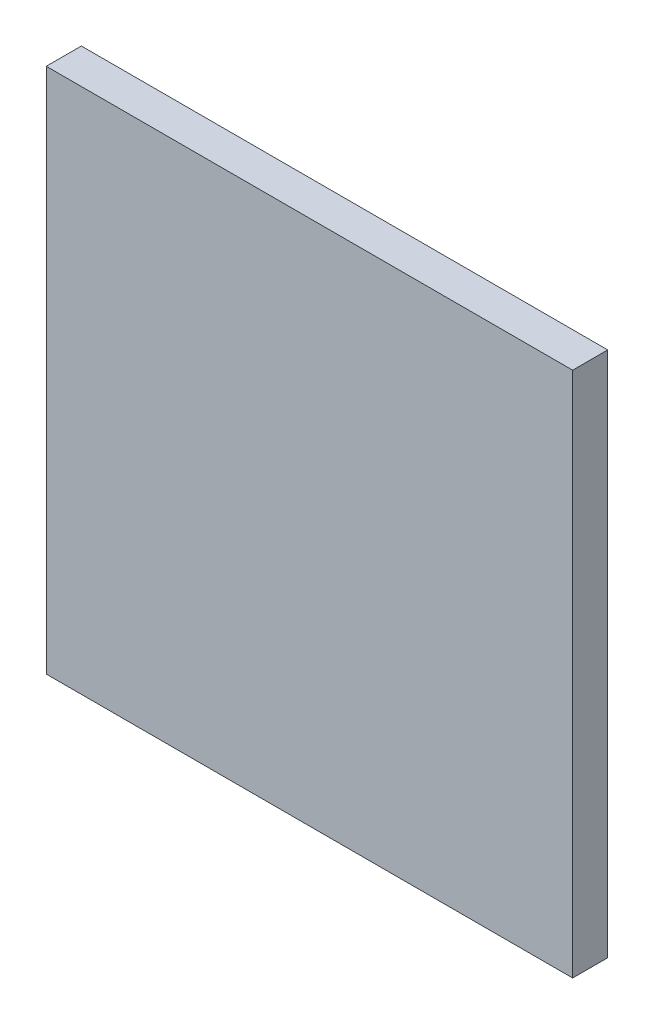
ISO-10303-21;
HEADER;
FILE_DESCRIPTION(('STEP AP214'),'2;1');
FILE_NAME('part.step','',(''),(''),'','','');
FILE_SCHEMA(('AUTOMOTIVE_DESIGN { 1 0 10303 214 1 1 1 1 }'));
ENDSEC;
DATA;
#1=APPLICATION_CONTEXT('core data for automotive mechanical design processes');
#2=APPLICATION_PROTOCOL_DEFINITION('international standard','automotive_design',2000,#1);
#3=PRODUCT_CONTEXT('',#1,'mechanical');
#4=PRODUCT('Part','Part','',(#3));
#5=PRODUCT_RELATED_PRODUCT_CATEGORY('part','',(#4));
#6=PRODUCT_DEFINITION_FORMATION('','',#4);
#7=PRODUCT_DEFINITION_CONTEXT('part definition',#1,'design');
#8=PRODUCT_DEFINITION('design','',#6,#7);
#9=PRODUCT_DEFINITION_SHAPE('','',#8);
#10=(LENGTH_UNIT() NAMED_UNIT(*) SI_UNIT(.MILLI.,.METRE.));
#11=(NAMED_UNIT(*) PLANE_ANGLE_UNIT() SI_UNIT($,.RADIAN.));
#12=(NAMED_UNIT(*) SI_UNIT($,.STERADIAN.) SOLID_ANGLE_UNIT());
#13=UNCERTAINTY_MEASURE_WITH_UNIT(LENGTH_MEASURE(1.E-05),#10,'distance_accuracy_value','');
#14=(GEOMETRIC_REPRESENTATION_CONTEXT(3) GLOBAL_UNCERTAINTY_ASSIGNED_CONTEXT((#13)) GLOBAL_UNIT_ASSIGNED_CONTEXT((#10,
#11,#12)) REPRESENTATION_CONTEXT('',''));
#15=CARTESIAN_POINT('',(0.,0.,0.));
#16=DIRECTION('',(0.,0.,1.));
#17=DIRECTION('',(1.,0.,0.));
#18=AXIS2_PLACEMENT_3D('',#15,#16,#17);
#19=CARTESIAN_POINT('',(15.,-15.,2.));
#20=DIRECTION('',(-1.,0.,0.));
#21=DIRECTION('',(0.,0.,1.));
#22=AXIS2_PLACEMENT_3D('',#19,#20,#21);
#23=PLANE('',#22);
#24=DIRECTION('',(0.,1.,0.));
#25=VECTOR('',#24,1.);
#26=CARTESIAN_POINT('',(15.,-15.,0.));
#27=LINE('',#26,#25);
#28=CARTESIAN_POINT('',(15.,-15.,0.));
#29=VERTEX_POINT('',#28);
#30=CARTESIAN_POINT('',(15.,15.,0.));
#31=VERTEX_POINT('',#30);
#32=EDGE_CURVE('E100',#29,#31,#27,.T.);
#33=ORIENTED_EDGE('',*,*,#32,.T.);
#34=DIRECTION('',(0.,0.,-1.));
#35=VECTOR('',#34,1.);
#36=CARTESIAN_POINT('',(15.,15.,2.));
#37=LINE('',#36,#35);
#38=CARTESIAN_POINT('',(15.,15.,2.));
#39=VERTEX_POINT('',#38);
#40=EDGE_CURVE('E11',#39,#31,#37,.T.);
#41=ORIENTED_EDGE('',*,*,#40,.F.);
#42=DIRECTION('',(0.,1.,0.));
#43=VECTOR('',#42,1.);
#44=CARTESIAN_POINT('',(15.,-15.,2.));
#45=LINE('',#44,#43);
#46=CARTESIAN_POINT('',(15.,-15.,2.));
#47=VERTEX_POINT('',#46);
#48=EDGE_CURVE('E88',#47,#39,#45,.T.);
#49=ORIENTED_EDGE('',*,*,#48,.F.);
#50=DIRECTION('',(0.,0.,-1.));
#51=VECTOR('',#50,1.);
#52=CARTESIAN_POINT('',(15.,-15.,2.));
#53=LINE('',#52,#51);
#54=EDGE_CURVE('E96',#47,#29,#53,.T.);
#55=ORIENTED_EDGE('',*,*,#54,.T.);
#56=EDGE_LOOP('',(#33,#41,#49,#55));
#57=FACE_BOUND('',#56,.T.);
#58=ADVANCED_FACE('F37',(#57),#23,.F.);
#59=CARTESIAN_POINT('',(-15.,15.,2.));
#60=DIRECTION('',(0.,-1.,0.));
#61=DIRECTION('',(0.,0.,-1.));
#62=AXIS2_PLACEMENT_3D('',#59,#60,#61);
#63=PLANE('',#62);
#64=DIRECTION('',(-1.,0.,0.));
#65=VECTOR('',#64,1.);
#66=CARTESIAN_POINT('',(-15.,15.,0.));
#67=LINE('',#66,#65);
#68=CARTESIAN_POINT('',(-15.,15.,0.));
#69=VERTEX_POINT('',#68);
#70=EDGE_CURVE('E92',#31,#69,#67,.T.);
#71=ORIENTED_EDGE('',*,*,#70,.T.);
#72=DIRECTION('',(0.,0.,-1.));
#73=VECTOR('',#72,1.);
#74=CARTESIAN_POINT('',(-15.,15.,2.));
#75=LINE('',#74,#73);
#76=CARTESIAN_POINT('',(-15.,15.,2.));
#77=VERTEX_POINT('',#76);
#78=EDGE_CURVE('E45',#77,#69,#75,.T.);
#79=ORIENTED_EDGE('',*,*,#78,.F.);
#80=DIRECTION('',(-1.,0.,0.));
#81=VECTOR('',#80,1.);
#82=CARTESIAN_POINT('',(-15.,15.,2.));
#83=LINE('',#82,#81);
#84=EDGE_CURVE('E83',#39,#77,#83,.T.);
#85=ORIENTED_EDGE('',*,*,#84,.F.);
#86=ORIENTED_EDGE('',*,*,#40,.T.);
#87=EDGE_LOOP('',(#71,#79,#85,#86));
#88=FACE_BOUND('',#87,.T.);
#89=ADVANCED_FACE('F91',(#88),#63,.F.);
#90=CARTESIAN_POINT('',(-15.,-15.,2.));
#91=DIRECTION('',(1.,0.,0.));
#92=DIRECTION('',(0.,0.,-1.));
#93=AXIS2_PLACEMENT_3D('',#90,#91,#92);
#94=PLANE('',#93);
#95=DIRECTION('',(0.,-1.,0.));
#96=VECTOR('',#95,1.);
#97=CARTESIAN_POINT('',(-15.,-15.,0.));
#98=LINE('',#97,#96);
#99=CARTESIAN_POINT('',(-15.,-15.,0.));
#100=VERTEX_POINT('',#99);
#101=EDGE_CURVE('E70',#69,#100,#98,.T.);
#102=ORIENTED_EDGE('',*,*,#101,.T.);
#103=DIRECTION('',(0.,0.,-1.));
#104=VECTOR('',#103,1.);
#105=CARTESIAN_POINT('',(-15.,-15.,2.));
#106=LINE('',#105,#104);
#107=CARTESIAN_POINT('',(-15.,-15.,2.));
#108=VERTEX_POINT('',#107);
#109=EDGE_CURVE('E93',#108,#100,#106,.T.);
#110=ORIENTED_EDGE('',*,*,#109,.F.);
#111=DIRECTION('',(0.,-1.,0.));
#112=VECTOR('',#111,1.);
#113=CARTESIAN_POINT('',(-15.,-15.,2.));
#114=LINE('',#113,#112);
#115=EDGE_CURVE('E86',#77,#108,#114,.T.);
#116=ORIENTED_EDGE('',*,*,#115,.F.);
#117=ORIENTED_EDGE('',*,*,#78,.T.);
#118=EDGE_LOOP('',(#102,#110,#116,#117));
#119=FACE_BOUND('',#118,.T.);
#120=ADVANCED_FACE('F94',(#119),#94,.F.);
#121=CARTESIAN_POINT('',(-15.,-15.,2.));
#122=DIRECTION('',(0.,1.,0.));
#123=DIRECTION('',(0.,0.,1.));
#124=AXIS2_PLACEMENT_3D('',#121,#122,#123);
#125=PLANE('',#124);
#126=DIRECTION('',(1.,0.,0.));
#127=VECTOR('',#126,1.);
#128=CARTESIAN_POINT('',(-15.,-15.,0.));
#129=LINE('',#128,#127);
#130=EDGE_CURVE('E76',#100,#29,#129,.T.);
#131=ORIENTED_EDGE('',*,*,#130,.T.);
#132=ORIENTED_EDGE('',*,*,#54,.F.);
#133=DIRECTION('',(1.,0.,0.));
#134=VECTOR('',#133,1.);
#135=CARTESIAN_POINT('',(-15.,-15.,2.));
#136=LINE('',#135,#134);
#137=EDGE_CURVE('E53',#108,#47,#136,.T.);
#138=ORIENTED_EDGE('',*,*,#137,.F.);
#139=ORIENTED_EDGE('',*,*,#109,.T.);
#140=EDGE_LOOP('',(#131,#132,#138,#139));
#141=FACE_BOUND('',#140,.T.);
#142=ADVANCED_FACE('F107',(#141),#125,.F.);
#143=CARTESIAN_POINT('',(0.,0.,2.));
#144=DIRECTION('',(0.,0.,-1.));
#145=DIRECTION('',(-1.,0.,0.));
#146=AXIS2_PLACEMENT_3D('',#143,#144,#145);
#147=PLANE('',#146);
#148=ORIENTED_EDGE('',*,*,#48,.T.);
#149=ORIENTED_EDGE('',*,*,#84,.T.);
#150=ORIENTED_EDGE('',*,*,#115,.T.);
#151=ORIENTED_EDGE('',*,*,#137,.T.);
#152=EDGE_LOOP('',(#148,#149,#150,#151));
#153=FACE_BOUND('',#152,.T.);
#154=ADVANCED_FACE('F84',(#153),#147,.F.);
#155=CARTESIAN_POINT('',(0.,0.,0.));
#156=DIRECTION('',(0.,0.,-1.));
#157=DIRECTION('',(-1.,0.,0.));
#158=AXIS2_PLACEMENT_3D('',#155,#156,#157);
#159=PLANE('',#158);
#160=ORIENTED_EDGE('',*,*,#32,.F.);
#161=ORIENTED_EDGE('',*,*,#130,.F.);
#162=ORIENTED_EDGE('',*,*,#101,.F.);
#163=ORIENTED_EDGE('',*,*,#70,.F.);
#164=EDGE_LOOP('',(#160,#161,#162,#163));
#165=FACE_BOUND('',#164,.T.);
#166=ADVANCED_FACE('F110',(#165),#159,.T.);
#167=CLOSED_SHELL('',(#58,#89,#120,#142,#154,#166));
#168=MANIFOLD_SOLID_BREP('B2',#167);
#169=ADVANCED_BREP_SHAPE_REPRESENTATION('',(#18,#168),#14);
#170=SHAPE_DEFINITION_REPRESENTATION(#9,#169);
ENDSEC;
END-ISO-10303-21;
